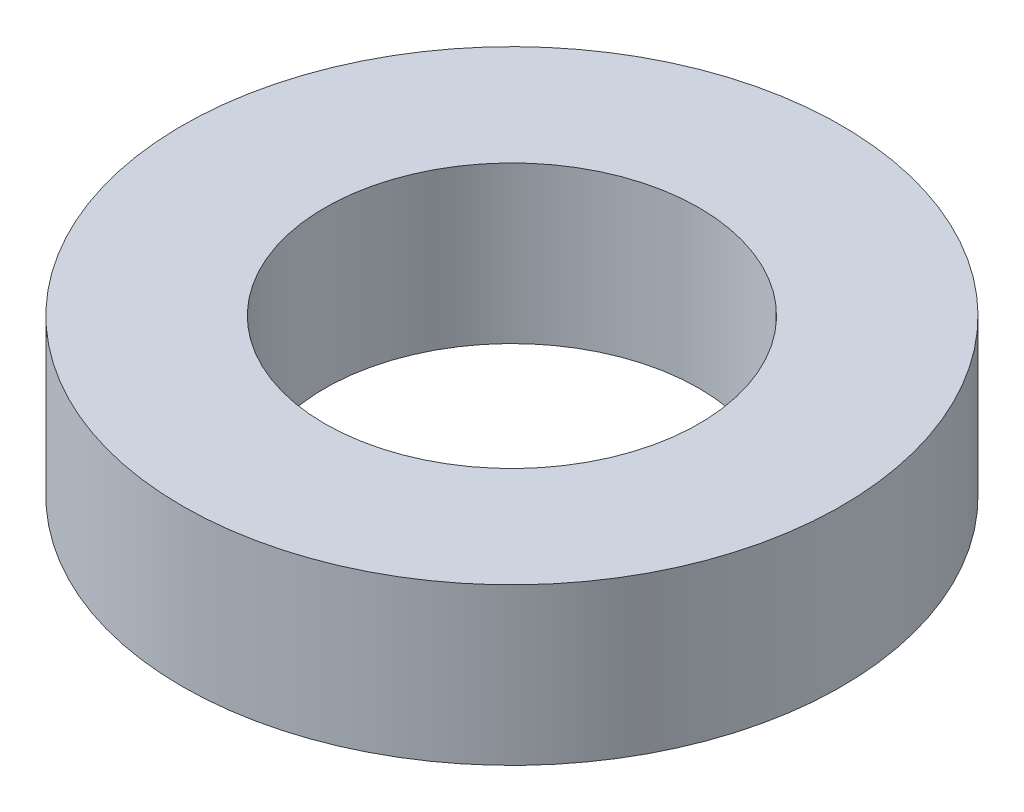
ISO-10303-21;
HEADER;
FILE_DESCRIPTION(('STEP AP214'),'2;1');
FILE_NAME('part.step','',(''),(''),'','','');
FILE_SCHEMA(('AUTOMOTIVE_DESIGN { 1 0 10303 214 1 1 1 1 }'));
ENDSEC;
DATA;
#1=APPLICATION_CONTEXT('core data for automotive mechanical design processes');
#2=APPLICATION_PROTOCOL_DEFINITION('international standard','automotive_design',2000,#1);
#3=PRODUCT_CONTEXT('',#1,'mechanical');
#4=PRODUCT('Part','Part','',(#3));
#5=PRODUCT_RELATED_PRODUCT_CATEGORY('part','',(#4));
#6=PRODUCT_DEFINITION_FORMATION('','',#4);
#7=PRODUCT_DEFINITION_CONTEXT('part definition',#1,'design');
#8=PRODUCT_DEFINITION('design','',#6,#7);
#9=PRODUCT_DEFINITION_SHAPE('','',#8);
#10=(LENGTH_UNIT() NAMED_UNIT(*) SI_UNIT(.MILLI.,.METRE.));
#11=(NAMED_UNIT(*) PLANE_ANGLE_UNIT() SI_UNIT($,.RADIAN.));
#12=(NAMED_UNIT(*) SI_UNIT($,.STERADIAN.) SOLID_ANGLE_UNIT());
#13=UNCERTAINTY_MEASURE_WITH_UNIT(LENGTH_MEASURE(1.E-05),#10,'distance_accuracy_value','');
#14=(GEOMETRIC_REPRESENTATION_CONTEXT(3) GLOBAL_UNCERTAINTY_ASSIGNED_CONTEXT((#13)) GLOBAL_UNIT_ASSIGNED_CONTEXT((#10,
#11,#12)) REPRESENTATION_CONTEXT('',''));
#15=CARTESIAN_POINT('',(0.,0.,0.));
#16=DIRECTION('',(0.,0.,1.));
#17=DIRECTION('',(1.,0.,0.));
#18=AXIS2_PLACEMENT_3D('',#15,#16,#17);
#19=CARTESIAN_POINT('',(0.,7.112,0.));
#20=DIRECTION('',(0.,1.,0.));
#21=DIRECTION('',(0.,0.,1.));
#22=AXIS2_PLACEMENT_3D('',#19,#20,#21);
#23=PLANE('',#22);
#24=CARTESIAN_POINT('',(0.,7.112,0.));
#25=DIRECTION('',(0.,1.,0.));
#26=DIRECTION('',(0.,0.,1.));
#27=AXIS2_PLACEMENT_3D('',#24,#25,#26);
#28=CIRCLE('',#27,14.986);
#29=CARTESIAN_POINT('',(0.,7.112,14.986));
#30=VERTEX_POINT('',#29);
#31=EDGE_CURVE('E10',#30,#30,#28,.T.);
#32=ORIENTED_EDGE('',*,*,#31,.T.);
#33=EDGE_LOOP('',(#32));
#34=FACE_BOUND('',#33,.T.);
#35=CARTESIAN_POINT('',(0.,7.112,0.));
#36=DIRECTION('',(0.,1.,0.));
#37=DIRECTION('',(0.,0.,1.));
#38=AXIS2_PLACEMENT_3D('',#35,#36,#37);
#39=CIRCLE('',#38,8.509);
#40=CARTESIAN_POINT('',(0.,7.112,8.509));
#41=VERTEX_POINT('',#40);
#42=EDGE_CURVE('E42',#41,#41,#39,.T.);
#43=ORIENTED_EDGE('',*,*,#42,.F.);
#44=EDGE_LOOP('',(#43));
#45=FACE_BOUND('',#44,.T.);
#46=ADVANCED_FACE('F31',(#34,#45),#23,.T.);
#47=CARTESIAN_POINT('',(0.,0.,0.));
#48=DIRECTION('',(0.,1.,0.));
#49=DIRECTION('',(0.,0.,1.));
#50=AXIS2_PLACEMENT_3D('',#47,#48,#49);
#51=PLANE('',#50);
#52=CARTESIAN_POINT('',(0.,0.,0.));
#53=DIRECTION('',(0.,1.,0.));
#54=DIRECTION('',(0.,0.,1.));
#55=AXIS2_PLACEMENT_3D('',#52,#53,#54);
#56=CIRCLE('',#55,14.986);
#57=CARTESIAN_POINT('',(0.,0.,14.986));
#58=VERTEX_POINT('',#57);
#59=EDGE_CURVE('E35',#58,#58,#56,.T.);
#60=ORIENTED_EDGE('',*,*,#59,.F.);
#61=EDGE_LOOP('',(#60));
#62=FACE_BOUND('',#61,.T.);
#63=CARTESIAN_POINT('',(0.,0.,0.));
#64=DIRECTION('',(0.,1.,0.));
#65=DIRECTION('',(0.,0.,1.));
#66=AXIS2_PLACEMENT_3D('',#63,#64,#65);
#67=CIRCLE('',#66,8.509);
#68=CARTESIAN_POINT('',(0.,0.,8.509));
#69=VERTEX_POINT('',#68);
#70=EDGE_CURVE('E44',#69,#69,#67,.T.);
#71=ORIENTED_EDGE('',*,*,#70,.T.);
#72=EDGE_LOOP('',(#71));
#73=FACE_BOUND('',#72,.T.);
#74=ADVANCED_FACE('F54',(#62,#73),#51,.F.);
#75=CARTESIAN_POINT('',(0.,7.112,0.));
#76=DIRECTION('',(0.,-1.,0.));
#77=DIRECTION('',(0.,0.,-1.));
#78=AXIS2_PLACEMENT_3D('',#75,#76,#77);
#79=CYLINDRICAL_SURFACE('',#78,14.986);
#80=ORIENTED_EDGE('',*,*,#31,.F.);
#81=EDGE_LOOP('',(#80));
#82=FACE_BOUND('',#81,.T.);
#83=ORIENTED_EDGE('',*,*,#59,.T.);
#84=EDGE_LOOP('',(#83));
#85=FACE_BOUND('',#84,.T.);
#86=ADVANCED_FACE('F33',(#82,#85),#79,.T.);
#87=CARTESIAN_POINT('',(0.,7.112,0.));
#88=DIRECTION('',(0.,-1.,0.));
#89=DIRECTION('',(0.,0.,-1.));
#90=AXIS2_PLACEMENT_3D('',#87,#88,#89);
#91=CYLINDRICAL_SURFACE('',#90,8.509);
#92=ORIENTED_EDGE('',*,*,#42,.T.);
#93=EDGE_LOOP('',(#92));
#94=FACE_BOUND('',#93,.T.);
#95=ORIENTED_EDGE('',*,*,#70,.F.);
#96=EDGE_LOOP('',(#95));
#97=FACE_BOUND('',#96,.T.);
#98=ADVANCED_FACE('F50',(#94,#97),#91,.F.);
#99=CLOSED_SHELL('',(#46,#74,#86,#98));
#100=MANIFOLD_SOLID_BREP('B2',#99);
#101=ADVANCED_BREP_SHAPE_REPRESENTATION('',(#18,#100),#14);
#102=SHAPE_DEFINITION_REPRESENTATION(#9,#101);
ENDSEC;
END-ISO-10303-21;
